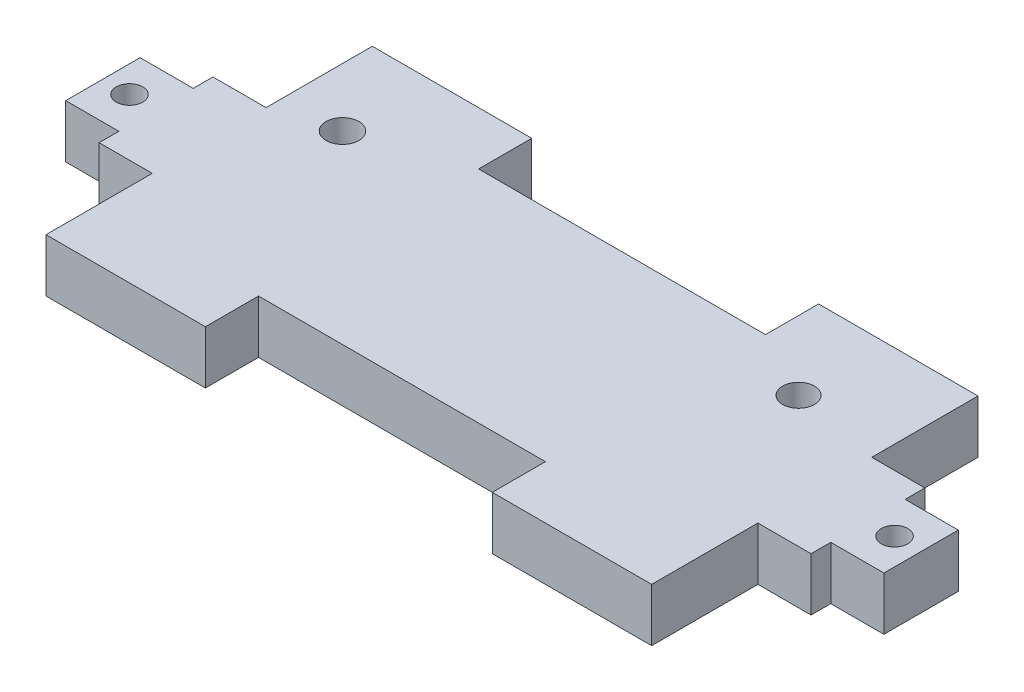
ISO-10303-21;
HEADER;
FILE_DESCRIPTION(('STEP AP214'),'2;1');
FILE_NAME('part.step','',(''),(''),'','','');
FILE_SCHEMA(('AUTOMOTIVE_DESIGN { 1 0 10303 214 1 1 1 1 }'));
ENDSEC;
DATA;
#1=APPLICATION_CONTEXT('core data for automotive mechanical design processes');
#2=APPLICATION_PROTOCOL_DEFINITION('international standard','automotive_design',2000,#1);
#3=PRODUCT_CONTEXT('',#1,'mechanical');
#4=PRODUCT('Part','Part','',(#3));
#5=PRODUCT_RELATED_PRODUCT_CATEGORY('part','',(#4));
#6=PRODUCT_DEFINITION_FORMATION('','',#4);
#7=PRODUCT_DEFINITION_CONTEXT('part definition',#1,'design');
#8=PRODUCT_DEFINITION('design','',#6,#7);
#9=PRODUCT_DEFINITION_SHAPE('','',#8);
#10=(LENGTH_UNIT() NAMED_UNIT(*) SI_UNIT(.MILLI.,.METRE.));
#11=(NAMED_UNIT(*) PLANE_ANGLE_UNIT() SI_UNIT($,.RADIAN.));
#12=(NAMED_UNIT(*) SI_UNIT($,.STERADIAN.) SOLID_ANGLE_UNIT());
#13=UNCERTAINTY_MEASURE_WITH_UNIT(LENGTH_MEASURE(1.E-05),#10,'distance_accuracy_value','');
#14=(GEOMETRIC_REPRESENTATION_CONTEXT(3) GLOBAL_UNCERTAINTY_ASSIGNED_CONTEXT((#13)) GLOBAL_UNIT_ASSIGNED_CONTEXT((#10,
#11,#12)) REPRESENTATION_CONTEXT('',''));
#15=CARTESIAN_POINT('',(0.,0.,0.));
#16=DIRECTION('',(0.,0.,1.));
#17=DIRECTION('',(1.,0.,0.));
#18=AXIS2_PLACEMENT_3D('',#15,#16,#17);
#19=CARTESIAN_POINT('',(85.09,0.,0.));
#20=DIRECTION('',(-1.,0.,0.));
#21=DIRECTION('',(0.,0.,1.));
#22=AXIS2_PLACEMENT_3D('',#19,#20,#21);
#23=PLANE('',#22);
#24=DIRECTION('',(0.,0.,-1.));
#25=VECTOR('',#24,1.);
#26=CARTESIAN_POINT('',(85.09,-6.35,0.));
#27=LINE('',#26,#25);
#28=CARTESIAN_POINT('',(85.09,-6.35,-8.70771027020123));
#29=VERTEX_POINT('',#28);
#30=CARTESIAN_POINT('',(85.09,-6.35,-17.5977102702012));
#31=VERTEX_POINT('',#30);
#32=EDGE_CURVE('E259',#29,#31,#27,.T.);
#33=ORIENTED_EDGE('',*,*,#32,.T.);
#34=DIRECTION('',(0.,-1.,0.));
#35=VECTOR('',#34,1.);
#36=CARTESIAN_POINT('',(85.09,0.,-17.5977102702012));
#37=LINE('',#36,#35);
#38=CARTESIAN_POINT('',(85.09,0.,-17.5977102702012));
#39=VERTEX_POINT('',#38);
#40=EDGE_CURVE('E11',#39,#31,#37,.T.);
#41=ORIENTED_EDGE('',*,*,#40,.F.);
#42=DIRECTION('',(0.,0.,-1.));
#43=VECTOR('',#42,1.);
#44=CARTESIAN_POINT('',(85.09,0.,0.));
#45=LINE('',#44,#43);
#46=CARTESIAN_POINT('',(85.09,0.,-8.70771027020123));
#47=VERTEX_POINT('',#46);
#48=EDGE_CURVE('E50',#47,#39,#45,.T.);
#49=ORIENTED_EDGE('',*,*,#48,.F.);
#50=DIRECTION('',(0.,-1.,0.));
#51=VECTOR('',#50,1.);
#52=CARTESIAN_POINT('',(85.09,0.,-8.70771027020123));
#53=LINE('',#52,#51);
#54=EDGE_CURVE('E35',#47,#29,#53,.T.);
#55=ORIENTED_EDGE('',*,*,#54,.T.);
#56=EDGE_LOOP('',(#33,#41,#49,#55));
#57=FACE_BOUND('',#56,.T.);
#58=ADVANCED_FACE('F32',(#57),#23,.F.);
#59=CARTESIAN_POINT('',(0.,0.,-17.5977102702012));
#60=DIRECTION('',(0.,0.,-1.));
#61=DIRECTION('',(-1.,0.,0.));
#62=AXIS2_PLACEMENT_3D('',#59,#60,#61);
#63=PLANE('',#62);
#64=DIRECTION('',(1.,0.,0.));
#65=VECTOR('',#64,1.);
#66=CARTESIAN_POINT('',(0.,-6.35,-17.5977102702012));
#67=LINE('',#66,#65);
#68=CARTESIAN_POINT('',(78.74,-6.35,-17.5977102702012));
#69=VERTEX_POINT('',#68);
#70=EDGE_CURVE('E333',#69,#31,#67,.T.);
#71=ORIENTED_EDGE('',*,*,#70,.F.);
#72=DIRECTION('',(0.,-1.,0.));
#73=VECTOR('',#72,1.);
#74=CARTESIAN_POINT('',(78.74,0.,-17.5977102702012));
#75=LINE('',#74,#73);
#76=CARTESIAN_POINT('',(78.74,0.,-17.5977102702012));
#77=VERTEX_POINT('',#76);
#78=EDGE_CURVE('E41',#77,#69,#75,.T.);
#79=ORIENTED_EDGE('',*,*,#78,.F.);
#80=DIRECTION('',(1.,0.,0.));
#81=VECTOR('',#80,1.);
#82=CARTESIAN_POINT('',(0.,0.,-17.5977102702012));
#83=LINE('',#82,#81);
#84=EDGE_CURVE('E242',#77,#39,#83,.T.);
#85=ORIENTED_EDGE('',*,*,#84,.T.);
#86=ORIENTED_EDGE('',*,*,#40,.T.);
#87=EDGE_LOOP('',(#71,#79,#85,#86));
#88=FACE_BOUND('',#87,.T.);
#89=ADVANCED_FACE('F406',(#88),#63,.T.);
#90=CARTESIAN_POINT('',(78.74,0.,0.));
#91=DIRECTION('',(1.,0.,0.));
#92=DIRECTION('',(0.,0.,-1.));
#93=AXIS2_PLACEMENT_3D('',#90,#91,#92);
#94=PLANE('',#93);
#95=DIRECTION('',(0.,0.,1.));
#96=VECTOR('',#95,1.);
#97=CARTESIAN_POINT('',(78.74,-6.35,0.));
#98=LINE('',#97,#96);
#99=CARTESIAN_POINT('',(78.74,-6.35,-19.9554205404025));
#100=VERTEX_POINT('',#99);
#101=EDGE_CURVE('E227',#100,#69,#98,.T.);
#102=ORIENTED_EDGE('',*,*,#101,.F.);
#103=DIRECTION('',(0.,-1.,0.));
#104=VECTOR('',#103,1.);
#105=CARTESIAN_POINT('',(78.74,0.,-19.9554205404025));
#106=LINE('',#105,#104);
#107=CARTESIAN_POINT('',(78.74,0.,-19.9554205404025));
#108=VERTEX_POINT('',#107);
#109=EDGE_CURVE('E222',#108,#100,#106,.T.);
#110=ORIENTED_EDGE('',*,*,#109,.F.);
#111=DIRECTION('',(0.,0.,1.));
#112=VECTOR('',#111,1.);
#113=CARTESIAN_POINT('',(78.74,0.,0.));
#114=LINE('',#113,#112);
#115=EDGE_CURVE('E226',#108,#77,#114,.T.);
#116=ORIENTED_EDGE('',*,*,#115,.T.);
#117=ORIENTED_EDGE('',*,*,#78,.T.);
#118=EDGE_LOOP('',(#102,#110,#116,#117));
#119=FACE_BOUND('',#118,.T.);
#120=ADVANCED_FACE('F224',(#119),#94,.T.);
#121=CARTESIAN_POINT('',(0.,0.,-19.9554205404025));
#122=DIRECTION('',(0.,0.,1.));
#123=DIRECTION('',(1.,0.,0.));
#124=AXIS2_PLACEMENT_3D('',#121,#122,#123);
#125=PLANE('',#124);
#126=DIRECTION('',(-1.,0.,0.));
#127=VECTOR('',#126,1.);
#128=CARTESIAN_POINT('',(0.,-6.35,-19.9554205404025));
#129=LINE('',#128,#127);
#130=CARTESIAN_POINT('',(72.39,-6.35,-19.9554205404025));
#131=VERTEX_POINT('',#130);
#132=EDGE_CURVE('E330',#100,#131,#129,.T.);
#133=ORIENTED_EDGE('',*,*,#132,.T.);
#134=DIRECTION('',(0.,-1.,0.));
#135=VECTOR('',#134,1.);
#136=CARTESIAN_POINT('',(72.39,0.,-19.9554205404025));
#137=LINE('',#136,#135);
#138=CARTESIAN_POINT('',(72.39,0.,-19.9554205404025));
#139=VERTEX_POINT('',#138);
#140=EDGE_CURVE('E231',#139,#131,#137,.T.);
#141=ORIENTED_EDGE('',*,*,#140,.F.);
#142=DIRECTION('',(-1.,0.,0.));
#143=VECTOR('',#142,1.);
#144=CARTESIAN_POINT('',(0.,0.,-19.9554205404025));
#145=LINE('',#144,#143);
#146=EDGE_CURVE('E234',#108,#139,#145,.T.);
#147=ORIENTED_EDGE('',*,*,#146,.F.);
#148=ORIENTED_EDGE('',*,*,#109,.T.);
#149=EDGE_LOOP('',(#133,#141,#147,#148));
#150=FACE_BOUND('',#149,.T.);
#151=ADVANCED_FACE('F235',(#150),#125,.F.);
#152=CARTESIAN_POINT('',(72.39,0.,0.));
#153=DIRECTION('',(1.,0.,0.));
#154=DIRECTION('',(0.,0.,-1.));
#155=AXIS2_PLACEMENT_3D('',#152,#153,#154);
#156=PLANE('',#155);
#157=DIRECTION('',(0.,0.,1.));
#158=VECTOR('',#157,1.);
#159=CARTESIAN_POINT('',(72.39,-6.35,0.));
#160=LINE('',#159,#158);
#161=CARTESIAN_POINT('',(72.39,-6.35,-32.6554205404025));
#162=VERTEX_POINT('',#161);
#163=EDGE_CURVE('E327',#162,#131,#160,.T.);
#164=ORIENTED_EDGE('',*,*,#163,.F.);
#165=DIRECTION('',(0.,-1.,0.));
#166=VECTOR('',#165,1.);
#167=CARTESIAN_POINT('',(72.39,0.,-32.6554205404025));
#168=LINE('',#167,#166);
#169=CARTESIAN_POINT('',(72.39,0.,-32.6554205404025));
#170=VERTEX_POINT('',#169);
#171=EDGE_CURVE('E350',#170,#162,#168,.T.);
#172=ORIENTED_EDGE('',*,*,#171,.F.);
#173=DIRECTION('',(0.,0.,1.));
#174=VECTOR('',#173,1.);
#175=CARTESIAN_POINT('',(72.39,0.,0.));
#176=LINE('',#175,#174);
#177=EDGE_CURVE('E238',#170,#139,#176,.T.);
#178=ORIENTED_EDGE('',*,*,#177,.T.);
#179=ORIENTED_EDGE('',*,*,#140,.T.);
#180=EDGE_LOOP('',(#164,#172,#178,#179));
#181=FACE_BOUND('',#180,.T.);
#182=ADVANCED_FACE('F420',(#181),#156,.T.);
#183=CARTESIAN_POINT('',(0.,0.,-32.6554205404025));
#184=DIRECTION('',(0.,0.,-1.));
#185=DIRECTION('',(-1.,0.,0.));
#186=AXIS2_PLACEMENT_3D('',#183,#184,#185);
#187=PLANE('',#186);
#188=DIRECTION('',(1.,0.,0.));
#189=VECTOR('',#188,1.);
#190=CARTESIAN_POINT('',(0.,-6.35,-32.6554205404025));
#191=LINE('',#190,#189);
#192=CARTESIAN_POINT('',(53.34,-6.35,-32.6554205404025));
#193=VERTEX_POINT('',#192);
#194=EDGE_CURVE('E324',#193,#162,#191,.T.);
#195=ORIENTED_EDGE('',*,*,#194,.F.);
#196=DIRECTION('',(0.,-1.,0.));
#197=VECTOR('',#196,1.);
#198=CARTESIAN_POINT('',(53.34,0.,-32.6554205404025));
#199=LINE('',#198,#197);
#200=CARTESIAN_POINT('',(53.34,0.,-32.6554205404025));
#201=VERTEX_POINT('',#200);
#202=EDGE_CURVE('E352',#201,#193,#199,.T.);
#203=ORIENTED_EDGE('',*,*,#202,.F.);
#204=DIRECTION('',(1.,0.,0.));
#205=VECTOR('',#204,1.);
#206=CARTESIAN_POINT('',(0.,0.,-32.6554205404025));
#207=LINE('',#206,#205);
#208=EDGE_CURVE('E993',#201,#170,#207,.T.);
#209=ORIENTED_EDGE('',*,*,#208,.T.);
#210=ORIENTED_EDGE('',*,*,#171,.T.);
#211=EDGE_LOOP('',(#195,#203,#209,#210));
#212=FACE_BOUND('',#211,.T.);
#213=ADVANCED_FACE('F423',(#212),#187,.T.);
#214=CARTESIAN_POINT('',(53.34,0.,0.));
#215=DIRECTION('',(1.,0.,0.));
#216=DIRECTION('',(0.,0.,-1.));
#217=AXIS2_PLACEMENT_3D('',#214,#215,#216);
#218=PLANE('',#217);
#219=DIRECTION('',(0.,0.,1.));
#220=VECTOR('',#219,1.);
#221=CARTESIAN_POINT('',(53.34,-6.35,0.));
#222=LINE('',#221,#220);
#223=CARTESIAN_POINT('',(53.34,-6.35,-26.3054205404025));
#224=VERTEX_POINT('',#223);
#225=EDGE_CURVE('E321',#193,#224,#222,.T.);
#226=ORIENTED_EDGE('',*,*,#225,.T.);
#227=DIRECTION('',(0.,-1.,0.));
#228=VECTOR('',#227,1.);
#229=CARTESIAN_POINT('',(53.34,0.,-26.3054205404025));
#230=LINE('',#229,#228);
#231=CARTESIAN_POINT('',(53.34,0.,-26.3054205404025));
#232=VERTEX_POINT('',#231);
#233=EDGE_CURVE('E354',#232,#224,#230,.T.);
#234=ORIENTED_EDGE('',*,*,#233,.F.);
#235=DIRECTION('',(0.,0.,1.));
#236=VECTOR('',#235,1.);
#237=CARTESIAN_POINT('',(53.34,0.,0.));
#238=LINE('',#237,#236);
#239=EDGE_CURVE('E990',#201,#232,#238,.T.);
#240=ORIENTED_EDGE('',*,*,#239,.F.);
#241=ORIENTED_EDGE('',*,*,#202,.T.);
#242=EDGE_LOOP('',(#226,#234,#240,#241));
#243=FACE_BOUND('',#242,.T.);
#244=ADVANCED_FACE('F427',(#243),#218,.F.);
#245=CARTESIAN_POINT('',(0.,0.,-26.3054205404025));
#246=DIRECTION('',(0.,0.,-1.));
#247=DIRECTION('',(-1.,0.,0.));
#248=AXIS2_PLACEMENT_3D('',#245,#246,#247);
#249=PLANE('',#248);
#250=DIRECTION('',(1.,0.,0.));
#251=VECTOR('',#250,1.);
#252=CARTESIAN_POINT('',(0.,-6.35,-26.3054205404025));
#253=LINE('',#252,#251);
#254=CARTESIAN_POINT('',(19.05,-6.35,-26.3054205404025));
#255=VERTEX_POINT('',#254);
#256=EDGE_CURVE('E318',#255,#224,#253,.T.);
#257=ORIENTED_EDGE('',*,*,#256,.F.);
#258=DIRECTION('',(0.,-1.,0.));
#259=VECTOR('',#258,1.);
#260=CARTESIAN_POINT('',(19.05,0.,-26.3054205404025));
#261=LINE('',#260,#259);
#262=CARTESIAN_POINT('',(19.05,0.,-26.3054205404025));
#263=VERTEX_POINT('',#262);
#264=EDGE_CURVE('E356',#263,#255,#261,.T.);
#265=ORIENTED_EDGE('',*,*,#264,.F.);
#266=DIRECTION('',(1.,0.,0.));
#267=VECTOR('',#266,1.);
#268=CARTESIAN_POINT('',(0.,0.,-26.3054205404025));
#269=LINE('',#268,#267);
#270=EDGE_CURVE('E988',#263,#232,#269,.T.);
#271=ORIENTED_EDGE('',*,*,#270,.T.);
#272=ORIENTED_EDGE('',*,*,#233,.T.);
#273=EDGE_LOOP('',(#257,#265,#271,#272));
#274=FACE_BOUND('',#273,.T.);
#275=ADVANCED_FACE('F431',(#274),#249,.T.);
#276=CARTESIAN_POINT('',(19.05,0.,0.));
#277=DIRECTION('',(1.,0.,0.));
#278=DIRECTION('',(0.,0.,-1.));
#279=AXIS2_PLACEMENT_3D('',#276,#277,#278);
#280=PLANE('',#279);
#281=DIRECTION('',(0.,0.,1.));
#282=VECTOR('',#281,1.);
#283=CARTESIAN_POINT('',(19.05,-6.35,0.));
#284=LINE('',#283,#282);
#285=CARTESIAN_POINT('',(19.05,-6.35,-32.6554205404025));
#286=VERTEX_POINT('',#285);
#287=EDGE_CURVE('E315',#286,#255,#284,.T.);
#288=ORIENTED_EDGE('',*,*,#287,.F.);
#289=DIRECTION('',(0.,-1.,0.));
#290=VECTOR('',#289,1.);
#291=CARTESIAN_POINT('',(19.05,0.,-32.6554205404025));
#292=LINE('',#291,#290);
#293=CARTESIAN_POINT('',(19.05,0.,-32.6554205404025));
#294=VERTEX_POINT('',#293);
#295=EDGE_CURVE('E358',#294,#286,#292,.T.);
#296=ORIENTED_EDGE('',*,*,#295,.F.);
#297=DIRECTION('',(0.,0.,1.));
#298=VECTOR('',#297,1.);
#299=CARTESIAN_POINT('',(19.05,0.,0.));
#300=LINE('',#299,#298);
#301=EDGE_CURVE('E999',#294,#263,#300,.T.);
#302=ORIENTED_EDGE('',*,*,#301,.T.);
#303=ORIENTED_EDGE('',*,*,#264,.T.);
#304=EDGE_LOOP('',(#288,#296,#302,#303));
#305=FACE_BOUND('',#304,.T.);
#306=ADVANCED_FACE('F435',(#305),#280,.T.);
#307=CARTESIAN_POINT('',(0.,0.,-32.6554205404025));
#308=DIRECTION('',(0.,0.,-1.));
#309=DIRECTION('',(-1.,0.,0.));
#310=AXIS2_PLACEMENT_3D('',#307,#308,#309);
#311=PLANE('',#310);
#312=DIRECTION('',(1.,0.,0.));
#313=VECTOR('',#312,1.);
#314=CARTESIAN_POINT('',(0.,-6.35,-32.6554205404025));
#315=LINE('',#314,#313);
#316=CARTESIAN_POINT('',(0.,-6.35,-32.6554205404025));
#317=VERTEX_POINT('',#316);
#318=EDGE_CURVE('E312',#317,#286,#315,.T.);
#319=ORIENTED_EDGE('',*,*,#318,.F.);
#320=DIRECTION('',(0.,-1.,0.));
#321=VECTOR('',#320,1.);
#322=CARTESIAN_POINT('',(0.,0.,-32.6554205404025));
#323=LINE('',#322,#321);
#324=CARTESIAN_POINT('',(0.,0.,-32.6554205404025));
#325=VERTEX_POINT('',#324);
#326=EDGE_CURVE('E360',#325,#317,#323,.T.);
#327=ORIENTED_EDGE('',*,*,#326,.F.);
#328=DIRECTION('',(1.,0.,0.));
#329=VECTOR('',#328,1.);
#330=CARTESIAN_POINT('',(0.,0.,-32.6554205404025));
#331=LINE('',#330,#329);
#332=EDGE_CURVE('E979',#325,#294,#331,.T.);
#333=ORIENTED_EDGE('',*,*,#332,.T.);
#334=ORIENTED_EDGE('',*,*,#295,.T.);
#335=EDGE_LOOP('',(#319,#327,#333,#334));
#336=FACE_BOUND('',#335,.T.);
#337=ADVANCED_FACE('F439',(#336),#311,.T.);
#338=CARTESIAN_POINT('',(0.,0.,0.));
#339=DIRECTION('',(1.,0.,0.));
#340=DIRECTION('',(0.,0.,-1.));
#341=AXIS2_PLACEMENT_3D('',#338,#339,#340);
#342=PLANE('',#341);
#343=DIRECTION('',(0.,0.,1.));
#344=VECTOR('',#343,1.);
#345=CARTESIAN_POINT('',(0.,-6.35,0.));
#346=LINE('',#345,#344);
#347=CARTESIAN_POINT('',(0.,-6.35,-19.9554205404025));
#348=VERTEX_POINT('',#347);
#349=EDGE_CURVE('E309',#317,#348,#346,.T.);
#350=ORIENTED_EDGE('',*,*,#349,.T.);
#351=DIRECTION('',(0.,-1.,0.));
#352=VECTOR('',#351,1.);
#353=CARTESIAN_POINT('',(0.,0.,-19.9554205404025));
#354=LINE('',#353,#352);
#355=CARTESIAN_POINT('',(0.,0.,-19.9554205404025));
#356=VERTEX_POINT('',#355);
#357=EDGE_CURVE('E362',#356,#348,#354,.T.);
#358=ORIENTED_EDGE('',*,*,#357,.F.);
#359=DIRECTION('',(0.,0.,1.));
#360=VECTOR('',#359,1.);
#361=CARTESIAN_POINT('',(0.,0.,0.));
#362=LINE('',#361,#360);
#363=EDGE_CURVE('E1002',#325,#356,#362,.T.);
#364=ORIENTED_EDGE('',*,*,#363,.F.);
#365=ORIENTED_EDGE('',*,*,#326,.T.);
#366=EDGE_LOOP('',(#350,#358,#364,#365));
#367=FACE_BOUND('',#366,.T.);
#368=ADVANCED_FACE('F443',(#367),#342,.F.);
#369=CARTESIAN_POINT('',(0.,0.,-19.9554205404025));
#370=DIRECTION('',(0.,0.,-1.));
#371=DIRECTION('',(-1.,0.,0.));
#372=AXIS2_PLACEMENT_3D('',#369,#370,#371);
#373=PLANE('',#372);
#374=DIRECTION('',(1.,0.,0.));
#375=VECTOR('',#374,1.);
#376=CARTESIAN_POINT('',(0.,-6.35,-19.9554205404025));
#377=LINE('',#376,#375);
#378=CARTESIAN_POINT('',(-6.35,-6.35,-19.9554205404025));
#379=VERTEX_POINT('',#378);
#380=EDGE_CURVE('E306',#379,#348,#377,.T.);
#381=ORIENTED_EDGE('',*,*,#380,.F.);
#382=DIRECTION('',(0.,-1.,0.));
#383=VECTOR('',#382,1.);
#384=CARTESIAN_POINT('',(-6.35,0.,-19.9554205404025));
#385=LINE('',#384,#383);
#386=CARTESIAN_POINT('',(-6.35,0.,-19.9554205404025));
#387=VERTEX_POINT('',#386);
#388=EDGE_CURVE('E364',#387,#379,#385,.T.);
#389=ORIENTED_EDGE('',*,*,#388,.F.);
#390=DIRECTION('',(1.,0.,0.));
#391=VECTOR('',#390,1.);
#392=CARTESIAN_POINT('',(0.,0.,-19.9554205404025));
#393=LINE('',#392,#391);
#394=EDGE_CURVE('E1004',#387,#356,#393,.T.);
#395=ORIENTED_EDGE('',*,*,#394,.T.);
#396=ORIENTED_EDGE('',*,*,#357,.T.);
#397=EDGE_LOOP('',(#381,#389,#395,#396));
#398=FACE_BOUND('',#397,.T.);
#399=ADVANCED_FACE('F447',(#398),#373,.T.);
#400=CARTESIAN_POINT('',(-6.34999999999999,0.,0.));
#401=DIRECTION('',(-1.,0.,0.));
#402=DIRECTION('',(0.,0.,1.));
#403=AXIS2_PLACEMENT_3D('',#400,#401,#402);
#404=PLANE('',#403);
#405=DIRECTION('',(0.,0.,-1.));
#406=VECTOR('',#405,1.);
#407=CARTESIAN_POINT('',(-6.34999999999999,-6.35,0.));
#408=LINE('',#407,#406);
#409=CARTESIAN_POINT('',(-6.35,-6.35,-17.5977102702012));
#410=VERTEX_POINT('',#409);
#411=EDGE_CURVE('E303',#410,#379,#408,.T.);
#412=ORIENTED_EDGE('',*,*,#411,.F.);
#413=DIRECTION('',(0.,-1.,0.));
#414=VECTOR('',#413,1.);
#415=CARTESIAN_POINT('',(-6.35,0.,-17.5977102702012));
#416=LINE('',#415,#414);
#417=CARTESIAN_POINT('',(-6.35,0.,-17.5977102702012));
#418=VERTEX_POINT('',#417);
#419=EDGE_CURVE('E366',#418,#410,#416,.T.);
#420=ORIENTED_EDGE('',*,*,#419,.F.);
#421=DIRECTION('',(0.,0.,-1.));
#422=VECTOR('',#421,1.);
#423=CARTESIAN_POINT('',(-6.34999999999999,0.,0.));
#424=LINE('',#423,#422);
#425=EDGE_CURVE('E969',#418,#387,#424,.T.);
#426=ORIENTED_EDGE('',*,*,#425,.T.);
#427=ORIENTED_EDGE('',*,*,#388,.T.);
#428=EDGE_LOOP('',(#412,#420,#426,#427));
#429=FACE_BOUND('',#428,.T.);
#430=ADVANCED_FACE('F451',(#429),#404,.T.);
#431=CARTESIAN_POINT('',(0.,0.,-17.5977102702012));
#432=DIRECTION('',(0.,0.,1.));
#433=DIRECTION('',(1.,0.,0.));
#434=AXIS2_PLACEMENT_3D('',#431,#432,#433);
#435=PLANE('',#434);
#436=DIRECTION('',(-1.,0.,0.));
#437=VECTOR('',#436,1.);
#438=CARTESIAN_POINT('',(0.,-6.35,-17.5977102702012));
#439=LINE('',#438,#437);
#440=CARTESIAN_POINT('',(-12.7,-6.35,-17.5977102702012));
#441=VERTEX_POINT('',#440);
#442=EDGE_CURVE('E300',#410,#441,#439,.T.);
#443=ORIENTED_EDGE('',*,*,#442,.T.);
#444=DIRECTION('',(0.,-1.,0.));
#445=VECTOR('',#444,1.);
#446=CARTESIAN_POINT('',(-12.7,0.,-17.5977102702012));
#447=LINE('',#446,#445);
#448=CARTESIAN_POINT('',(-12.7,0.,-17.5977102702012));
#449=VERTEX_POINT('',#448);
#450=EDGE_CURVE('E368',#449,#441,#447,.T.);
#451=ORIENTED_EDGE('',*,*,#450,.F.);
#452=DIRECTION('',(-1.,0.,0.));
#453=VECTOR('',#452,1.);
#454=CARTESIAN_POINT('',(0.,0.,-17.5977102702012));
#455=LINE('',#454,#453);
#456=EDGE_CURVE('E1007',#418,#449,#455,.T.);
#457=ORIENTED_EDGE('',*,*,#456,.F.);
#458=ORIENTED_EDGE('',*,*,#419,.T.);
#459=EDGE_LOOP('',(#443,#451,#457,#458));
#460=FACE_BOUND('',#459,.T.);
#461=ADVANCED_FACE('F455',(#460),#435,.F.);
#462=CARTESIAN_POINT('',(-12.7,0.,0.));
#463=DIRECTION('',(-1.,0.,0.));
#464=DIRECTION('',(0.,0.,1.));
#465=AXIS2_PLACEMENT_3D('',#462,#463,#464);
#466=PLANE('',#465);
#467=DIRECTION('',(0.,0.,-1.));
#468=VECTOR('',#467,1.);
#469=CARTESIAN_POINT('',(-12.7,-6.35,0.));
#470=LINE('',#469,#468);
#471=CARTESIAN_POINT('',(-12.7,-6.35,-8.70771027020124));
#472=VERTEX_POINT('',#471);
#473=EDGE_CURVE('E297',#472,#441,#470,.T.);
#474=ORIENTED_EDGE('',*,*,#473,.F.);
#475=DIRECTION('',(0.,-1.,0.));
#476=VECTOR('',#475,1.);
#477=CARTESIAN_POINT('',(-12.7,0.,-8.70771027020124));
#478=LINE('',#477,#476);
#479=CARTESIAN_POINT('',(-12.7,0.,-8.70771027020124));
#480=VERTEX_POINT('',#479);
#481=EDGE_CURVE('E370',#480,#472,#478,.T.);
#482=ORIENTED_EDGE('',*,*,#481,.F.);
#483=DIRECTION('',(0.,0.,-1.));
#484=VECTOR('',#483,1.);
#485=CARTESIAN_POINT('',(-12.7,0.,0.));
#486=LINE('',#485,#484);
#487=EDGE_CURVE('E963',#480,#449,#486,.T.);
#488=ORIENTED_EDGE('',*,*,#487,.T.);
#489=ORIENTED_EDGE('',*,*,#450,.T.);
#490=EDGE_LOOP('',(#474,#482,#488,#489));
#491=FACE_BOUND('',#490,.T.);
#492=ADVANCED_FACE('F459',(#491),#466,.T.);
#493=CARTESIAN_POINT('',(0.,0.,-8.70771027020124));
#494=DIRECTION('',(0.,0.,1.));
#495=DIRECTION('',(1.,0.,0.));
#496=AXIS2_PLACEMENT_3D('',#493,#494,#495);
#497=PLANE('',#496);
#498=DIRECTION('',(-1.,0.,0.));
#499=VECTOR('',#498,1.);
#500=CARTESIAN_POINT('',(0.,-6.35,-8.70771027020124));
#501=LINE('',#500,#499);
#502=CARTESIAN_POINT('',(-6.35,-6.35,-8.70771027020124));
#503=VERTEX_POINT('',#502);
#504=EDGE_CURVE('E294',#503,#472,#501,.T.);
#505=ORIENTED_EDGE('',*,*,#504,.F.);
#506=DIRECTION('',(0.,-1.,0.));
#507=VECTOR('',#506,1.);
#508=CARTESIAN_POINT('',(-6.35,0.,-8.70771027020124));
#509=LINE('',#508,#507);
#510=CARTESIAN_POINT('',(-6.35,0.,-8.70771027020124));
#511=VERTEX_POINT('',#510);
#512=EDGE_CURVE('E372',#511,#503,#509,.T.);
#513=ORIENTED_EDGE('',*,*,#512,.F.);
#514=DIRECTION('',(-1.,0.,0.));
#515=VECTOR('',#514,1.);
#516=CARTESIAN_POINT('',(0.,0.,-8.70771027020124));
#517=LINE('',#516,#515);
#518=EDGE_CURVE('E959',#511,#480,#517,.T.);
#519=ORIENTED_EDGE('',*,*,#518,.T.);
#520=ORIENTED_EDGE('',*,*,#481,.T.);
#521=EDGE_LOOP('',(#505,#513,#519,#520));
#522=FACE_BOUND('',#521,.T.);
#523=ADVANCED_FACE('F463',(#522),#497,.T.);
#524=CARTESIAN_POINT('',(-6.34999999999999,0.,0.));
#525=DIRECTION('',(-1.,0.,0.));
#526=DIRECTION('',(0.,0.,1.));
#527=AXIS2_PLACEMENT_3D('',#524,#525,#526);
#528=PLANE('',#527);
#529=DIRECTION('',(0.,0.,-1.));
#530=VECTOR('',#529,1.);
#531=CARTESIAN_POINT('',(-6.34999999999999,-6.35,0.));
#532=LINE('',#531,#530);
#533=CARTESIAN_POINT('',(-6.35,-6.35,-6.35));
#534=VERTEX_POINT('',#533);
#535=EDGE_CURVE('E291',#534,#503,#532,.T.);
#536=ORIENTED_EDGE('',*,*,#535,.F.);
#537=DIRECTION('',(0.,-1.,0.));
#538=VECTOR('',#537,1.);
#539=CARTESIAN_POINT('',(-6.35,0.,-6.35));
#540=LINE('',#539,#538);
#541=CARTESIAN_POINT('',(-6.35,0.,-6.35));
#542=VERTEX_POINT('',#541);
#543=EDGE_CURVE('E374',#542,#534,#540,.T.);
#544=ORIENTED_EDGE('',*,*,#543,.F.);
#545=DIRECTION('',(0.,0.,-1.));
#546=VECTOR('',#545,1.);
#547=CARTESIAN_POINT('',(-6.34999999999999,0.,0.));
#548=LINE('',#547,#546);
#549=EDGE_CURVE('E953',#542,#511,#548,.T.);
#550=ORIENTED_EDGE('',*,*,#549,.T.);
#551=ORIENTED_EDGE('',*,*,#512,.T.);
#552=EDGE_LOOP('',(#536,#544,#550,#551));
#553=FACE_BOUND('',#552,.T.);
#554=ADVANCED_FACE('F467',(#553),#528,.T.);
#555=CARTESIAN_POINT('',(0.,0.,-6.35));
#556=DIRECTION('',(0.,0.,-1.));
#557=DIRECTION('',(-1.,0.,0.));
#558=AXIS2_PLACEMENT_3D('',#555,#556,#557);
#559=PLANE('',#558);
#560=DIRECTION('',(1.,0.,0.));
#561=VECTOR('',#560,1.);
#562=CARTESIAN_POINT('',(0.,-6.35,-6.35));
#563=LINE('',#562,#561);
#564=CARTESIAN_POINT('',(0.,-6.35,-6.35));
#565=VERTEX_POINT('',#564);
#566=EDGE_CURVE('E288',#534,#565,#563,.T.);
#567=ORIENTED_EDGE('',*,*,#566,.T.);
#568=DIRECTION('',(0.,-1.,0.));
#569=VECTOR('',#568,1.);
#570=CARTESIAN_POINT('',(0.,0.,-6.35));
#571=LINE('',#570,#569);
#572=CARTESIAN_POINT('',(0.,0.,-6.35));
#573=VERTEX_POINT('',#572);
#574=EDGE_CURVE('E376',#573,#565,#571,.T.);
#575=ORIENTED_EDGE('',*,*,#574,.F.);
#576=DIRECTION('',(1.,0.,0.));
#577=VECTOR('',#576,1.);
#578=CARTESIAN_POINT('',(0.,0.,-6.35));
#579=LINE('',#578,#577);
#580=EDGE_CURVE('E950',#542,#573,#579,.T.);
#581=ORIENTED_EDGE('',*,*,#580,.F.);
#582=ORIENTED_EDGE('',*,*,#543,.T.);
#583=EDGE_LOOP('',(#567,#575,#581,#582));
#584=FACE_BOUND('',#583,.T.);
#585=ADVANCED_FACE('F471',(#584),#559,.F.);
#586=CARTESIAN_POINT('',(0.,0.,0.));
#587=DIRECTION('',(-1.,0.,0.));
#588=DIRECTION('',(0.,0.,1.));
#589=AXIS2_PLACEMENT_3D('',#586,#587,#588);
#590=PLANE('',#589);
#591=DIRECTION('',(0.,0.,-1.));
#592=VECTOR('',#591,1.);
#593=CARTESIAN_POINT('',(0.,-6.35,0.));
#594=LINE('',#593,#592);
#595=CARTESIAN_POINT('',(0.,-6.35,6.35));
#596=VERTEX_POINT('',#595);
#597=EDGE_CURVE('E285',#596,#565,#594,.T.);
#598=ORIENTED_EDGE('',*,*,#597,.F.);
#599=DIRECTION('',(0.,-1.,0.));
#600=VECTOR('',#599,1.);
#601=CARTESIAN_POINT('',(0.,0.,6.35));
#602=LINE('',#601,#600);
#603=CARTESIAN_POINT('',(0.,0.,6.35));
#604=VERTEX_POINT('',#603);
#605=EDGE_CURVE('E378',#604,#596,#602,.T.);
#606=ORIENTED_EDGE('',*,*,#605,.F.);
#607=DIRECTION('',(0.,0.,-1.));
#608=VECTOR('',#607,1.);
#609=CARTESIAN_POINT('',(0.,0.,0.));
#610=LINE('',#609,#608);
#611=EDGE_CURVE('E948',#604,#573,#610,.T.);
#612=ORIENTED_EDGE('',*,*,#611,.T.);
#613=ORIENTED_EDGE('',*,*,#574,.T.);
#614=EDGE_LOOP('',(#598,#606,#612,#613));
#615=FACE_BOUND('',#614,.T.);
#616=ADVANCED_FACE('F475',(#615),#590,.T.);
#617=CARTESIAN_POINT('',(0.,0.,6.35));
#618=DIRECTION('',(0.,0.,1.));
#619=DIRECTION('',(1.,0.,0.));
#620=AXIS2_PLACEMENT_3D('',#617,#618,#619);
#621=PLANE('',#620);
#622=DIRECTION('',(-1.,0.,0.));
#623=VECTOR('',#622,1.);
#624=CARTESIAN_POINT('',(0.,-6.35,6.35));
#625=LINE('',#624,#623);
#626=CARTESIAN_POINT('',(19.05,-6.35,6.35));
#627=VERTEX_POINT('',#626);
#628=EDGE_CURVE('E282',#627,#596,#625,.T.);
#629=ORIENTED_EDGE('',*,*,#628,.F.);
#630=DIRECTION('',(0.,-1.,0.));
#631=VECTOR('',#630,1.);
#632=CARTESIAN_POINT('',(19.05,0.,6.35));
#633=LINE('',#632,#631);
#634=CARTESIAN_POINT('',(19.05,0.,6.35));
#635=VERTEX_POINT('',#634);
#636=EDGE_CURVE('E380',#635,#627,#633,.T.);
#637=ORIENTED_EDGE('',*,*,#636,.F.);
#638=DIRECTION('',(-1.,0.,0.));
#639=VECTOR('',#638,1.);
#640=CARTESIAN_POINT('',(0.,0.,6.35));
#641=LINE('',#640,#639);
#642=EDGE_CURVE('E941',#635,#604,#641,.T.);
#643=ORIENTED_EDGE('',*,*,#642,.T.);
#644=ORIENTED_EDGE('',*,*,#605,.T.);
#645=EDGE_LOOP('',(#629,#637,#643,#644));
#646=FACE_BOUND('',#645,.T.);
#647=ADVANCED_FACE('F479',(#646),#621,.T.);
#648=CARTESIAN_POINT('',(19.05,0.,0.));
#649=DIRECTION('',(-1.,0.,0.));
#650=DIRECTION('',(0.,0.,1.));
#651=AXIS2_PLACEMENT_3D('',#648,#649,#650);
#652=PLANE('',#651);
#653=DIRECTION('',(0.,0.,-1.));
#654=VECTOR('',#653,1.);
#655=CARTESIAN_POINT('',(19.05,-6.35,0.));
#656=LINE('',#655,#654);
#657=CARTESIAN_POINT('',(19.05,-6.35,0.));
#658=VERTEX_POINT('',#657);
#659=EDGE_CURVE('E280',#627,#658,#656,.T.);
#660=ORIENTED_EDGE('',*,*,#659,.T.);
#661=DIRECTION('',(0.,-1.,0.));
#662=VECTOR('',#661,1.);
#663=CARTESIAN_POINT('',(19.05,0.,0.));
#664=LINE('',#663,#662);
#665=CARTESIAN_POINT('',(19.05,0.,0.));
#666=VERTEX_POINT('',#665);
#667=EDGE_CURVE('E382',#666,#658,#664,.T.);
#668=ORIENTED_EDGE('',*,*,#667,.F.);
#669=DIRECTION('',(0.,0.,-1.));
#670=VECTOR('',#669,1.);
#671=CARTESIAN_POINT('',(19.05,0.,0.));
#672=LINE('',#671,#670);
#673=EDGE_CURVE('E938',#635,#666,#672,.T.);
#674=ORIENTED_EDGE('',*,*,#673,.F.);
#675=ORIENTED_EDGE('',*,*,#636,.T.);
#676=EDGE_LOOP('',(#660,#668,#674,#675));
#677=FACE_BOUND('',#676,.T.);
#678=ADVANCED_FACE('F483',(#677),#652,.F.);
#679=CARTESIAN_POINT('',(0.,0.,0.));
#680=DIRECTION('',(0.,0.,-1.));
#681=DIRECTION('',(-1.,0.,0.));
#682=AXIS2_PLACEMENT_3D('',#679,#680,#681);
#683=PLANE('',#682);
#684=DIRECTION('',(1.,0.,0.));
#685=VECTOR('',#684,1.);
#686=CARTESIAN_POINT('',(0.,-6.35,0.));
#687=LINE('',#686,#685);
#688=CARTESIAN_POINT('',(53.34,-6.35,0.));
#689=VERTEX_POINT('',#688);
#690=EDGE_CURVE('E277',#658,#689,#687,.T.);
#691=ORIENTED_EDGE('',*,*,#690,.T.);
#692=DIRECTION('',(0.,-1.,0.));
#693=VECTOR('',#692,1.);
#694=CARTESIAN_POINT('',(53.34,0.,0.));
#695=LINE('',#694,#693);
#696=CARTESIAN_POINT('',(53.34,0.,0.));
#697=VERTEX_POINT('',#696);
#698=EDGE_CURVE('E385',#697,#689,#695,.T.);
#699=ORIENTED_EDGE('',*,*,#698,.F.);
#700=DIRECTION('',(1.,0.,0.));
#701=VECTOR('',#700,1.);
#702=CARTESIAN_POINT('',(0.,0.,0.));
#703=LINE('',#702,#701);
#704=EDGE_CURVE('E936',#666,#697,#703,.T.);
#705=ORIENTED_EDGE('',*,*,#704,.F.);
#706=ORIENTED_EDGE('',*,*,#667,.T.);
#707=EDGE_LOOP('',(#691,#699,#705,#706));
#708=FACE_BOUND('',#707,.T.);
#709=ADVANCED_FACE('F487',(#708),#683,.F.);
#710=CARTESIAN_POINT('',(53.34,0.,0.));
#711=DIRECTION('',(-1.,0.,0.));
#712=DIRECTION('',(0.,0.,1.));
#713=AXIS2_PLACEMENT_3D('',#710,#711,#712);
#714=PLANE('',#713);
#715=DIRECTION('',(0.,0.,-1.));
#716=VECTOR('',#715,1.);
#717=CARTESIAN_POINT('',(53.34,-6.35,0.));
#718=LINE('',#717,#716);
#719=CARTESIAN_POINT('',(53.34,-6.35,6.35));
#720=VERTEX_POINT('',#719);
#721=EDGE_CURVE('E274',#720,#689,#718,.T.);
#722=ORIENTED_EDGE('',*,*,#721,.F.);
#723=DIRECTION('',(0.,-1.,0.));
#724=VECTOR('',#723,1.);
#725=CARTESIAN_POINT('',(53.34,0.,6.35));
#726=LINE('',#725,#724);
#727=CARTESIAN_POINT('',(53.34,0.,6.35));
#728=VERTEX_POINT('',#727);
#729=EDGE_CURVE('E387',#728,#720,#726,.T.);
#730=ORIENTED_EDGE('',*,*,#729,.F.);
#731=DIRECTION('',(0.,0.,-1.));
#732=VECTOR('',#731,1.);
#733=CARTESIAN_POINT('',(53.34,0.,0.));
#734=LINE('',#733,#732);
#735=EDGE_CURVE('E1017',#728,#697,#734,.T.);
#736=ORIENTED_EDGE('',*,*,#735,.T.);
#737=ORIENTED_EDGE('',*,*,#698,.T.);
#738=EDGE_LOOP('',(#722,#730,#736,#737));
#739=FACE_BOUND('',#738,.T.);
#740=ADVANCED_FACE('F491',(#739),#714,.T.);
#741=CARTESIAN_POINT('',(0.,0.,6.35));
#742=DIRECTION('',(0.,0.,1.));
#743=DIRECTION('',(1.,0.,0.));
#744=AXIS2_PLACEMENT_3D('',#741,#742,#743);
#745=PLANE('',#744);
#746=DIRECTION('',(-1.,0.,0.));
#747=VECTOR('',#746,1.);
#748=CARTESIAN_POINT('',(0.,-6.35,6.35));
#749=LINE('',#748,#747);
#750=CARTESIAN_POINT('',(72.39,-6.35,6.35));
#751=VERTEX_POINT('',#750);
#752=EDGE_CURVE('E271',#751,#720,#749,.T.);
#753=ORIENTED_EDGE('',*,*,#752,.F.);
#754=DIRECTION('',(0.,-1.,0.));
#755=VECTOR('',#754,1.);
#756=CARTESIAN_POINT('',(72.39,0.,6.35));
#757=LINE('',#756,#755);
#758=CARTESIAN_POINT('',(72.39,0.,6.35));
#759=VERTEX_POINT('',#758);
#760=EDGE_CURVE('E389',#759,#751,#757,.T.);
#761=ORIENTED_EDGE('',*,*,#760,.F.);
#762=DIRECTION('',(-1.,0.,0.));
#763=VECTOR('',#762,1.);
#764=CARTESIAN_POINT('',(0.,0.,6.35));
#765=LINE('',#764,#763);
#766=EDGE_CURVE('E927',#759,#728,#765,.T.);
#767=ORIENTED_EDGE('',*,*,#766,.T.);
#768=ORIENTED_EDGE('',*,*,#729,.T.);
#769=EDGE_LOOP('',(#753,#761,#767,#768));
#770=FACE_BOUND('',#769,.T.);
#771=ADVANCED_FACE('F495',(#770),#745,.T.);
#772=CARTESIAN_POINT('',(72.39,0.,0.));
#773=DIRECTION('',(-1.,0.,0.));
#774=DIRECTION('',(0.,0.,1.));
#775=AXIS2_PLACEMENT_3D('',#772,#773,#774);
#776=PLANE('',#775);
#777=DIRECTION('',(0.,0.,-1.));
#778=VECTOR('',#777,1.);
#779=CARTESIAN_POINT('',(72.39,-6.35,0.));
#780=LINE('',#779,#778);
#781=CARTESIAN_POINT('',(72.39,-6.35,-6.35));
#782=VERTEX_POINT('',#781);
#783=EDGE_CURVE('E268',#751,#782,#780,.T.);
#784=ORIENTED_EDGE('',*,*,#783,.T.);
#785=DIRECTION('',(0.,-1.,0.));
#786=VECTOR('',#785,1.);
#787=CARTESIAN_POINT('',(72.39,0.,-6.35));
#788=LINE('',#787,#786);
#789=CARTESIAN_POINT('',(72.39,0.,-6.35));
#790=VERTEX_POINT('',#789);
#791=EDGE_CURVE('E391',#790,#782,#788,.T.);
#792=ORIENTED_EDGE('',*,*,#791,.F.);
#793=DIRECTION('',(0.,0.,-1.));
#794=VECTOR('',#793,1.);
#795=CARTESIAN_POINT('',(72.39,0.,0.));
#796=LINE('',#795,#794);
#797=EDGE_CURVE('E1020',#759,#790,#796,.T.);
#798=ORIENTED_EDGE('',*,*,#797,.F.);
#799=ORIENTED_EDGE('',*,*,#760,.T.);
#800=EDGE_LOOP('',(#784,#792,#798,#799));
#801=FACE_BOUND('',#800,.T.);
#802=ADVANCED_FACE('F499',(#801),#776,.F.);
#803=CARTESIAN_POINT('',(0.,0.,-6.35000000000001));
#804=DIRECTION('',(0.,0.,1.));
#805=DIRECTION('',(1.,0.,0.));
#806=AXIS2_PLACEMENT_3D('',#803,#804,#805);
#807=PLANE('',#806);
#808=DIRECTION('',(-1.,0.,0.));
#809=VECTOR('',#808,1.);
#810=CARTESIAN_POINT('',(0.,-6.35,-6.35000000000001));
#811=LINE('',#810,#809);
#812=CARTESIAN_POINT('',(78.74,-6.35,-6.35));
#813=VERTEX_POINT('',#812);
#814=EDGE_CURVE('E265',#813,#782,#811,.T.);
#815=ORIENTED_EDGE('',*,*,#814,.F.);
#816=DIRECTION('',(0.,-1.,0.));
#817=VECTOR('',#816,1.);
#818=CARTESIAN_POINT('',(78.74,0.,-6.35));
#819=LINE('',#818,#817);
#820=CARTESIAN_POINT('',(78.74,0.,-6.35));
#821=VERTEX_POINT('',#820);
#822=EDGE_CURVE('E393',#821,#813,#819,.T.);
#823=ORIENTED_EDGE('',*,*,#822,.F.);
#824=DIRECTION('',(-1.,0.,0.));
#825=VECTOR('',#824,1.);
#826=CARTESIAN_POINT('',(0.,0.,-6.35000000000001));
#827=LINE('',#826,#825);
#828=EDGE_CURVE('E921',#821,#790,#827,.T.);
#829=ORIENTED_EDGE('',*,*,#828,.T.);
#830=ORIENTED_EDGE('',*,*,#791,.T.);
#831=EDGE_LOOP('',(#815,#823,#829,#830));
#832=FACE_BOUND('',#831,.T.);
#833=ADVANCED_FACE('F503',(#832),#807,.T.);
#834=CARTESIAN_POINT('',(78.74,0.,0.));
#835=DIRECTION('',(-1.,0.,0.));
#836=DIRECTION('',(0.,0.,1.));
#837=AXIS2_PLACEMENT_3D('',#834,#835,#836);
#838=PLANE('',#837);
#839=DIRECTION('',(0.,0.,-1.));
#840=VECTOR('',#839,1.);
#841=CARTESIAN_POINT('',(78.74,-6.35,0.));
#842=LINE('',#841,#840);
#843=CARTESIAN_POINT('',(78.74,-6.35,-8.70771027020123));
#844=VERTEX_POINT('',#843);
#845=EDGE_CURVE('E263',#813,#844,#842,.T.);
#846=ORIENTED_EDGE('',*,*,#845,.T.);
#847=DIRECTION('',(0.,-1.,0.));
#848=VECTOR('',#847,1.);
#849=CARTESIAN_POINT('',(78.74,0.,-8.70771027020123));
#850=LINE('',#849,#848);
#851=CARTESIAN_POINT('',(78.74,0.,-8.70771027020123));
#852=VERTEX_POINT('',#851);
#853=EDGE_CURVE('E394',#852,#844,#850,.T.);
#854=ORIENTED_EDGE('',*,*,#853,.F.);
#855=DIRECTION('',(0.,0.,-1.));
#856=VECTOR('',#855,1.);
#857=CARTESIAN_POINT('',(78.74,0.,0.));
#858=LINE('',#857,#856);
#859=EDGE_CURVE('E1023',#821,#852,#858,.T.);
#860=ORIENTED_EDGE('',*,*,#859,.F.);
#861=ORIENTED_EDGE('',*,*,#822,.T.);
#862=EDGE_LOOP('',(#846,#854,#860,#861));
#863=FACE_BOUND('',#862,.T.);
#864=ADVANCED_FACE('F507',(#863),#838,.F.);
#865=CARTESIAN_POINT('',(81.915,0.,-13.1527102702012));
#866=DIRECTION('',(0.,-1.,0.));
#867=DIRECTION('',(0.,0.,-1.));
#868=AXIS2_PLACEMENT_3D('',#865,#866,#867);
#869=CYLINDRICAL_SURFACE('',#868,1.5875);
#870=CARTESIAN_POINT('',(81.915,0.,-13.1527102702012));
#871=DIRECTION('',(0.,-1.,0.));
#872=DIRECTION('',(0.,0.,-1.));
#873=AXIS2_PLACEMENT_3D('',#870,#871,#872);
#874=CIRCLE('',#873,1.5875);
#875=CARTESIAN_POINT('',(81.915,0.,-14.7402102702012));
#876=VERTEX_POINT('',#875);
#877=EDGE_CURVE('E253',#876,#876,#874,.F.);
#878=ORIENTED_EDGE('',*,*,#877,.T.);
#879=EDGE_LOOP('',(#878));
#880=FACE_BOUND('',#879,.T.);
#881=CARTESIAN_POINT('',(81.915,-6.35,-13.1527102702012));
#882=DIRECTION('',(0.,-1.,0.));
#883=DIRECTION('',(0.,0.,-1.));
#884=AXIS2_PLACEMENT_3D('',#881,#882,#883);
#885=CIRCLE('',#884,1.5875);
#886=CARTESIAN_POINT('',(81.915,-6.35,-14.7402102702012));
#887=VERTEX_POINT('',#886);
#888=EDGE_CURVE('E342',#887,#887,#885,.F.);
#889=ORIENTED_EDGE('',*,*,#888,.F.);
#890=EDGE_LOOP('',(#889));
#891=FACE_BOUND('',#890,.T.);
#892=ADVANCED_FACE('F510',(#880,#891),#869,.F.);
#893=CARTESIAN_POINT('',(6.985,0.,-22.098));
#894=DIRECTION('',(0.,-1.,0.));
#895=DIRECTION('',(0.,0.,-1.));
#896=AXIS2_PLACEMENT_3D('',#893,#894,#895);
#897=CYLINDRICAL_SURFACE('',#896,1.96728344562255);
#898=CARTESIAN_POINT('',(6.985,0.,-22.098));
#899=DIRECTION('',(0.,-1.,0.));
#900=DIRECTION('',(0.,0.,-1.));
#901=AXIS2_PLACEMENT_3D('',#898,#899,#900);
#902=CIRCLE('',#901,1.96728344562255);
#903=CARTESIAN_POINT('',(6.985,0.,-24.0652834456226));
#904=VERTEX_POINT('',#903);
#905=EDGE_CURVE('E250',#904,#904,#902,.F.);
#906=ORIENTED_EDGE('',*,*,#905,.T.);
#907=EDGE_LOOP('',(#906));
#908=FACE_BOUND('',#907,.T.);
#909=CARTESIAN_POINT('',(6.985,-6.35,-22.098));
#910=DIRECTION('',(0.,-1.,0.));
#911=DIRECTION('',(0.,0.,-1.));
#912=AXIS2_PLACEMENT_3D('',#909,#910,#911);
#913=CIRCLE('',#912,1.96728344562255);
#914=CARTESIAN_POINT('',(6.985,-6.35,-24.0652834456226));
#915=VERTEX_POINT('',#914);
#916=EDGE_CURVE('E339',#915,#915,#913,.F.);
#917=ORIENTED_EDGE('',*,*,#916,.F.);
#918=EDGE_LOOP('',(#917));
#919=FACE_BOUND('',#918,.T.);
#920=ADVANCED_FACE('F521',(#908,#919),#897,.F.);
#921=CARTESIAN_POINT('',(61.595,0.,-21.9997780491));
#922=DIRECTION('',(0.,-1.,0.));
#923=DIRECTION('',(0.,0.,-1.));
#924=AXIS2_PLACEMENT_3D('',#921,#922,#923);
#925=CYLINDRICAL_SURFACE('',#924,1.90500000000001);
#926=CARTESIAN_POINT('',(61.595,0.,-21.9997780491));
#927=DIRECTION('',(0.,-1.,0.));
#928=DIRECTION('',(0.,0.,-1.));
#929=AXIS2_PLACEMENT_3D('',#926,#927,#928);
#930=CIRCLE('',#929,1.90500000000001);
#931=CARTESIAN_POINT('',(61.595,0.,-23.9047780491));
#932=VERTEX_POINT('',#931);
#933=EDGE_CURVE('E244',#932,#932,#930,.F.);
#934=ORIENTED_EDGE('',*,*,#933,.T.);
#935=EDGE_LOOP('',(#934));
#936=FACE_BOUND('',#935,.T.);
#937=CARTESIAN_POINT('',(61.595,-6.35,-21.9997780491));
#938=DIRECTION('',(0.,-1.,0.));
#939=DIRECTION('',(0.,0.,-1.));
#940=AXIS2_PLACEMENT_3D('',#937,#938,#939);
#941=CIRCLE('',#940,1.90500000000001);
#942=CARTESIAN_POINT('',(61.595,-6.35,-23.9047780491));
#943=VERTEX_POINT('',#942);
#944=EDGE_CURVE('E336',#943,#943,#941,.F.);
#945=ORIENTED_EDGE('',*,*,#944,.F.);
#946=EDGE_LOOP('',(#945));
#947=FACE_BOUND('',#946,.T.);
#948=ADVANCED_FACE('F415',(#936,#947),#925,.F.);
#949=CARTESIAN_POINT('',(0.,0.,-8.70771027020123));
#950=DIRECTION('',(0.,0.,-1.));
#951=DIRECTION('',(-1.,0.,0.));
#952=AXIS2_PLACEMENT_3D('',#949,#950,#951);
#953=PLANE('',#952);
#954=DIRECTION('',(1.,0.,0.));
#955=VECTOR('',#954,1.);
#956=CARTESIAN_POINT('',(0.,-6.35,-8.70771027020123));
#957=LINE('',#956,#955);
#958=EDGE_CURVE('E261',#844,#29,#957,.T.);
#959=ORIENTED_EDGE('',*,*,#958,.T.);
#960=ORIENTED_EDGE('',*,*,#54,.F.);
#961=DIRECTION('',(1.,0.,0.));
#962=VECTOR('',#961,1.);
#963=CARTESIAN_POINT('',(0.,0.,-8.70771027020123));
#964=LINE('',#963,#962);
#965=EDGE_CURVE('E149',#852,#47,#964,.T.);
#966=ORIENTED_EDGE('',*,*,#965,.F.);
#967=ORIENTED_EDGE('',*,*,#853,.T.);
#968=EDGE_LOOP('',(#959,#960,#966,#967));
#969=FACE_BOUND('',#968,.T.);
#970=ADVANCED_FACE('F512',(#969),#953,.F.);
#971=CARTESIAN_POINT('',(-9.525,0.,-13.1527102702012));
#972=DIRECTION('',(0.,-1.,0.));
#973=DIRECTION('',(0.,0.,-1.));
#974=AXIS2_PLACEMENT_3D('',#971,#972,#973);
#975=CYLINDRICAL_SURFACE('',#974,1.5875);
#976=CARTESIAN_POINT('',(-9.525,0.,-13.1527102702012));
#977=DIRECTION('',(0.,-1.,0.));
#978=DIRECTION('',(0.,0.,-1.));
#979=AXIS2_PLACEMENT_3D('',#976,#977,#978);
#980=CIRCLE('',#979,1.5875);
#981=CARTESIAN_POINT('',(-9.525,0.,-14.7402102702012));
#982=VERTEX_POINT('',#981);
#983=EDGE_CURVE('E256',#982,#982,#980,.F.);
#984=ORIENTED_EDGE('',*,*,#983,.T.);
#985=EDGE_LOOP('',(#984));
#986=FACE_BOUND('',#985,.T.);
#987=CARTESIAN_POINT('',(-9.525,-6.35,-13.1527102702012));
#988=DIRECTION('',(0.,-1.,0.));
#989=DIRECTION('',(0.,0.,-1.));
#990=AXIS2_PLACEMENT_3D('',#987,#988,#989);
#991=CIRCLE('',#990,1.5875);
#992=CARTESIAN_POINT('',(-9.525,-6.35,-14.7402102702012));
#993=VERTEX_POINT('',#992);
#994=EDGE_CURVE('E345',#993,#993,#991,.F.);
#995=ORIENTED_EDGE('',*,*,#994,.F.);
#996=EDGE_LOOP('',(#995));
#997=FACE_BOUND('',#996,.T.);
#998=ADVANCED_FACE('F514',(#986,#997),#975,.F.);
#999=CARTESIAN_POINT('',(0.,0.,0.));
#1000=DIRECTION('',(0.,-1.,0.));
#1001=DIRECTION('',(0.,0.,-1.));
#1002=AXIS2_PLACEMENT_3D('',#999,#1000,#1001);
#1003=PLANE('',#1002);
#1004=ORIENTED_EDGE('',*,*,#48,.T.);
#1005=ORIENTED_EDGE('',*,*,#84,.F.);
#1006=ORIENTED_EDGE('',*,*,#115,.F.);
#1007=ORIENTED_EDGE('',*,*,#146,.T.);
#1008=ORIENTED_EDGE('',*,*,#177,.F.);
#1009=ORIENTED_EDGE('',*,*,#208,.F.);
#1010=ORIENTED_EDGE('',*,*,#239,.T.);
#1011=ORIENTED_EDGE('',*,*,#270,.F.);
#1012=ORIENTED_EDGE('',*,*,#301,.F.);
#1013=ORIENTED_EDGE('',*,*,#332,.F.);
#1014=ORIENTED_EDGE('',*,*,#363,.T.);
#1015=ORIENTED_EDGE('',*,*,#394,.F.);
#1016=ORIENTED_EDGE('',*,*,#425,.F.);
#1017=ORIENTED_EDGE('',*,*,#456,.T.);
#1018=ORIENTED_EDGE('',*,*,#487,.F.);
#1019=ORIENTED_EDGE('',*,*,#518,.F.);
#1020=ORIENTED_EDGE('',*,*,#549,.F.);
#1021=ORIENTED_EDGE('',*,*,#580,.T.);
#1022=ORIENTED_EDGE('',*,*,#611,.F.);
#1023=ORIENTED_EDGE('',*,*,#642,.F.);
#1024=ORIENTED_EDGE('',*,*,#673,.T.);
#1025=ORIENTED_EDGE('',*,*,#704,.T.);
#1026=ORIENTED_EDGE('',*,*,#735,.F.);
#1027=ORIENTED_EDGE('',*,*,#766,.F.);
#1028=ORIENTED_EDGE('',*,*,#797,.T.);
#1029=ORIENTED_EDGE('',*,*,#828,.F.);
#1030=ORIENTED_EDGE('',*,*,#859,.T.);
#1031=ORIENTED_EDGE('',*,*,#965,.T.);
#1032=EDGE_LOOP('',(#1004,#1005,#1006,#1007,#1008,#1009,#1010,#1011,#1012,#1013,#1014,#1015,
#1016,#1017,#1018,#1019,#1020,#1021,#1022,#1023,#1024,#1025,#1026,#1027,#1028,#1029,#1030,#1031));
#1033=FACE_BOUND('',#1032,.T.);
#1034=ORIENTED_EDGE('',*,*,#933,.F.);
#1035=EDGE_LOOP('',(#1034));
#1036=FACE_BOUND('',#1035,.T.);
#1037=ORIENTED_EDGE('',*,*,#905,.F.);
#1038=EDGE_LOOP('',(#1037));
#1039=FACE_BOUND('',#1038,.T.);
#1040=ORIENTED_EDGE('',*,*,#877,.F.);
#1041=EDGE_LOOP('',(#1040));
#1042=FACE_BOUND('',#1041,.T.);
#1043=ORIENTED_EDGE('',*,*,#983,.F.);
#1044=EDGE_LOOP('',(#1043));
#1045=FACE_BOUND('',#1044,.T.);
#1046=ADVANCED_FACE('F240',(#1033,#1036,#1039,#1042,#1045),#1003,.F.);
#1047=CARTESIAN_POINT('',(0.,-6.35,0.));
#1048=DIRECTION('',(0.,-1.,0.));
#1049=DIRECTION('',(0.,0.,-1.));
#1050=AXIS2_PLACEMENT_3D('',#1047,#1048,#1049);
#1051=PLANE('',#1050);
#1052=ORIENTED_EDGE('',*,*,#32,.F.);
#1053=ORIENTED_EDGE('',*,*,#958,.F.);
#1054=ORIENTED_EDGE('',*,*,#845,.F.);
#1055=ORIENTED_EDGE('',*,*,#814,.T.);
#1056=ORIENTED_EDGE('',*,*,#783,.F.);
#1057=ORIENTED_EDGE('',*,*,#752,.T.);
#1058=ORIENTED_EDGE('',*,*,#721,.T.);
#1059=ORIENTED_EDGE('',*,*,#690,.F.);
#1060=ORIENTED_EDGE('',*,*,#659,.F.);
#1061=ORIENTED_EDGE('',*,*,#628,.T.);
#1062=ORIENTED_EDGE('',*,*,#597,.T.);
#1063=ORIENTED_EDGE('',*,*,#566,.F.);
#1064=ORIENTED_EDGE('',*,*,#535,.T.);
#1065=ORIENTED_EDGE('',*,*,#504,.T.);
#1066=ORIENTED_EDGE('',*,*,#473,.T.);
#1067=ORIENTED_EDGE('',*,*,#442,.F.);
#1068=ORIENTED_EDGE('',*,*,#411,.T.);
#1069=ORIENTED_EDGE('',*,*,#380,.T.);
#1070=ORIENTED_EDGE('',*,*,#349,.F.);
#1071=ORIENTED_EDGE('',*,*,#318,.T.);
#1072=ORIENTED_EDGE('',*,*,#287,.T.);
#1073=ORIENTED_EDGE('',*,*,#256,.T.);
#1074=ORIENTED_EDGE('',*,*,#225,.F.);
#1075=ORIENTED_EDGE('',*,*,#194,.T.);
#1076=ORIENTED_EDGE('',*,*,#163,.T.);
#1077=ORIENTED_EDGE('',*,*,#132,.F.);
#1078=ORIENTED_EDGE('',*,*,#101,.T.);
#1079=ORIENTED_EDGE('',*,*,#70,.T.);
#1080=EDGE_LOOP('',(#1052,#1053,#1054,#1055,#1056,#1057,#1058,#1059,#1060,#1061,#1062,#1063,
#1064,#1065,#1066,#1067,#1068,#1069,#1070,#1071,#1072,#1073,#1074,#1075,#1076,#1077,#1078,#1079));
#1081=FACE_BOUND('',#1080,.T.);
#1082=ORIENTED_EDGE('',*,*,#944,.T.);
#1083=EDGE_LOOP('',(#1082));
#1084=FACE_BOUND('',#1083,.T.);
#1085=ORIENTED_EDGE('',*,*,#916,.T.);
#1086=EDGE_LOOP('',(#1085));
#1087=FACE_BOUND('',#1086,.T.);
#1088=ORIENTED_EDGE('',*,*,#888,.T.);
#1089=EDGE_LOOP('',(#1088));
#1090=FACE_BOUND('',#1089,.T.);
#1091=ORIENTED_EDGE('',*,*,#994,.T.);
#1092=EDGE_LOOP('',(#1091));
#1093=FACE_BOUND('',#1092,.T.);
#1094=ADVANCED_FACE('F403',(#1081,#1084,#1087,#1090,#1093),#1051,.T.);
#1095=CLOSED_SHELL('',(#58,#89,#120,#151,#182,#213,#244,#275,#306,#337,#368,#399,#430,#461,#492,
#523,#554,#585,#616,#647,#678,#709,#740,#771,#802,#833,#864,#892,#920,#948,#970,#998,#1046,#1094));
#1096=MANIFOLD_SOLID_BREP('B2',#1095);
#1097=ADVANCED_BREP_SHAPE_REPRESENTATION('',(#18,#1096),#14);
#1098=SHAPE_DEFINITION_REPRESENTATION(#9,#1097);
ENDSEC;
END-ISO-10303-21;
